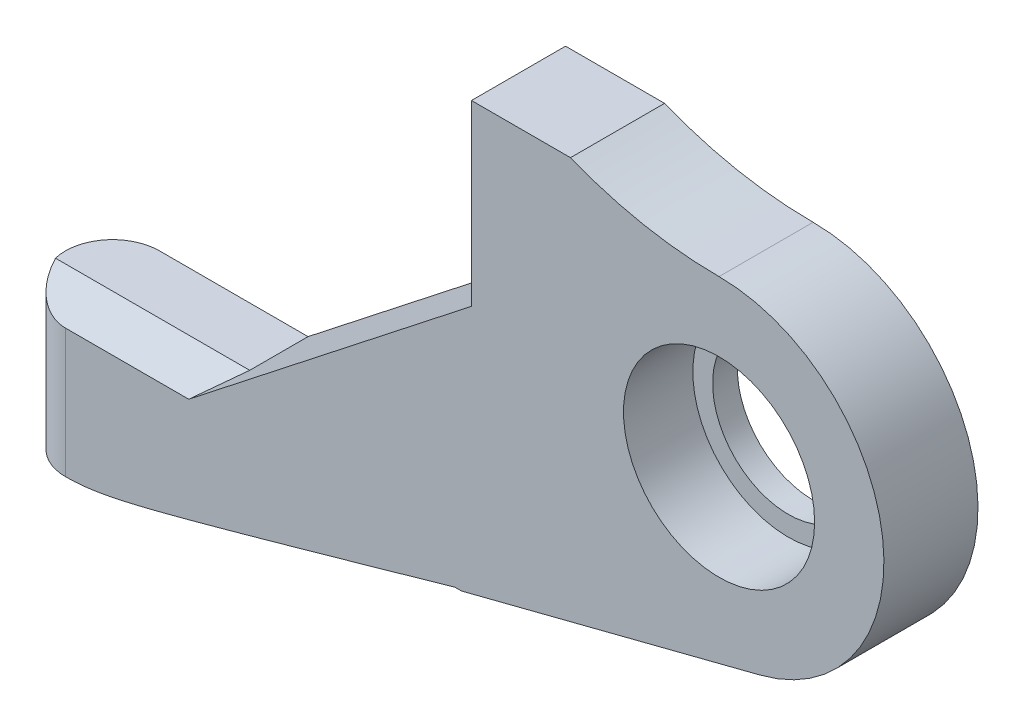
ISO-10303-21;
HEADER;
FILE_DESCRIPTION(('STEP AP214'),'2;1');
FILE_NAME('part.step','',(''),(''),'','','');
FILE_SCHEMA(('AUTOMOTIVE_DESIGN { 1 0 10303 214 1 1 1 1 }'));
ENDSEC;
DATA;
#1=APPLICATION_CONTEXT('core data for automotive mechanical design processes');
#2=APPLICATION_PROTOCOL_DEFINITION('international standard','automotive_design',2000,#1);
#3=PRODUCT_CONTEXT('',#1,'mechanical');
#4=PRODUCT('Part','Part','',(#3));
#5=PRODUCT_RELATED_PRODUCT_CATEGORY('part','',(#4));
#6=PRODUCT_DEFINITION_FORMATION('','',#4);
#7=PRODUCT_DEFINITION_CONTEXT('part definition',#1,'design');
#8=PRODUCT_DEFINITION('design','',#6,#7);
#9=PRODUCT_DEFINITION_SHAPE('','',#8);
#10=(LENGTH_UNIT() NAMED_UNIT(*) SI_UNIT(.MILLI.,.METRE.));
#11=(NAMED_UNIT(*) PLANE_ANGLE_UNIT() SI_UNIT($,.RADIAN.));
#12=(NAMED_UNIT(*) SI_UNIT($,.STERADIAN.) SOLID_ANGLE_UNIT());
#13=UNCERTAINTY_MEASURE_WITH_UNIT(LENGTH_MEASURE(1.E-05),#10,'distance_accuracy_value','');
#14=(GEOMETRIC_REPRESENTATION_CONTEXT(3) GLOBAL_UNCERTAINTY_ASSIGNED_CONTEXT((#13)) GLOBAL_UNIT_ASSIGNED_CONTEXT((#10,
#11,#12)) REPRESENTATION_CONTEXT('',''));
#15=CARTESIAN_POINT('',(0.,0.,0.));
#16=DIRECTION('',(0.,0.,1.));
#17=DIRECTION('',(1.,0.,0.));
#18=AXIS2_PLACEMENT_3D('',#15,#16,#17);
#19=CARTESIAN_POINT('',(16.35,-29.65,4.75));
#20=DIRECTION('',(0.,0.,1.));
#21=DIRECTION('',(1.,0.,0.));
#22=AXIS2_PLACEMENT_3D('',#19,#20,#21);
#23=PLANE('',#22);
#24=CARTESIAN_POINT('',(16.35,-29.65,4.75));
#25=DIRECTION('',(0.,0.,1.));
#26=DIRECTION('',(1.,0.,0.));
#27=AXIS2_PLACEMENT_3D('',#24,#25,#26);
#28=CIRCLE('',#27,16.65);
#29=CARTESIAN_POINT('',(20.4827919201644,-45.7789345880199,4.75));
#30=VERTEX_POINT('',#29);
#31=CARTESIAN_POINT('',(16.3500000000001,-13.,4.75));
#32=VERTEX_POINT('',#31);
#33=EDGE_CURVE('E185',#30,#32,#28,.T.);
#34=ORIENTED_EDGE('',*,*,#33,.T.);
#35=CARTESIAN_POINT('',(16.35,27.2431034482756,4.75));
#36=DIRECTION('',(0.,0.,1.));
#37=DIRECTION('',(1.,0.,0.));
#38=AXIS2_PLACEMENT_3D('',#35,#36,#37);
#39=CIRCLE('',#38,40.2431034482756);
#40=CARTESIAN_POINT('',(1.35000000000002,-10.1,4.75));
#41=VERTEX_POINT('',#40);
#42=EDGE_CURVE('E127',#41,#32,#39,.T.);
#43=ORIENTED_EDGE('',*,*,#42,.F.);
#44=DIRECTION('',(1.,0.,0.));
#45=VECTOR('',#44,1.);
#46=CARTESIAN_POINT('',(-8.64999999999998,-10.1,4.75));
#47=LINE('',#46,#45);
#48=CARTESIAN_POINT('',(-8.64999999999998,-10.1,4.75));
#49=VERTEX_POINT('',#48);
#50=EDGE_CURVE('E121',#49,#41,#47,.T.);
#51=ORIENTED_EDGE('',*,*,#50,.F.);
#52=DIRECTION('',(0.,1.,0.));
#53=VECTOR('',#52,1.);
#54=CARTESIAN_POINT('',(-8.64999999999998,-28.1013112114567,4.75));
#55=LINE('',#54,#53);
#56=CARTESIAN_POINT('',(-8.64999999999998,-28.1013112114567,4.75));
#57=VERTEX_POINT('',#56);
#58=EDGE_CURVE('E126',#57,#49,#55,.T.);
#59=ORIENTED_EDGE('',*,*,#58,.F.);
#60=DIRECTION('',(-0.786757426627153,-0.617262303763173,0.));
#61=VECTOR('',#60,1.);
#62=CARTESIAN_POINT('',(-34.65,-48.5,4.75));
#63=LINE('',#62,#61);
#64=CARTESIAN_POINT('',(-37.1991834567918,-50.5,4.75));
#65=VERTEX_POINT('',#64);
#66=EDGE_CURVE('E187',#57,#65,#63,.T.);
#67=ORIENTED_EDGE('',*,*,#66,.T.);
#68=DIRECTION('',(-1.,0.,0.));
#69=VECTOR('',#68,1.);
#70=CARTESIAN_POINT('',(-49.65,-50.5,4.75));
#71=LINE('',#70,#69);
#72=CARTESIAN_POINT('',(-49.65,-50.5,4.75));
#73=VERTEX_POINT('',#72);
#74=EDGE_CURVE('E315',#65,#73,#71,.T.);
#75=ORIENTED_EDGE('',*,*,#74,.T.);
#76=DIRECTION('',(0.,-1.,0.));
#77=VECTOR('',#76,1.);
#78=CARTESIAN_POINT('',(-49.65,-48.5,4.75));
#79=LINE('',#78,#77);
#80=CARTESIAN_POINT('',(-49.65,-63.5,4.75));
#81=VERTEX_POINT('',#80);
#82=EDGE_CURVE('E178',#73,#81,#79,.T.);
#83=ORIENTED_EDGE('',*,*,#82,.T.);
#84=CARTESIAN_POINT('',(-49.65,-63.5,4.75));
#85=CARTESIAN_POINT('',(-49.5478346514389,-63.5000034732593,4.75));
#86=CARTESIAN_POINT('',(-49.4456717505136,-63.4990544664872,4.75));
#87=CARTESIAN_POINT('',(-49.2413832701538,-63.4952813861621,4.75));
#88=CARTESIAN_POINT('',(-49.1392576897795,-63.4924573636201,4.75));
#89=CARTESIAN_POINT('',(-48.833052005964,-63.4812202753719,4.75));
#90=CARTESIAN_POINT('',(-48.6290680871602,-63.4700421473421,4.75));
#91=CARTESIAN_POINT('',(-48.2220793998145,-63.4409092581559,4.75));
#92=CARTESIAN_POINT('',(-48.0190734567737,-63.422970482818,4.75));
#93=CARTESIAN_POINT('',(-47.6136686075827,-63.3811079136988,4.75));
#94=CARTESIAN_POINT('',(-47.4112697562115,-63.3571835953505,4.75));
#95=CARTESIAN_POINT('',(-47.007754452504,-63.3043021436262,4.75));
#96=CARTESIAN_POINT('',(-46.8066359750545,-63.2753602871825,4.75));
#97=CARTESIAN_POINT('',(-46.4050656194471,-63.2132292509357,4.75));
#98=CARTESIAN_POINT('',(-46.204613728707,-63.1800401517748,4.75));
#99=CARTESIAN_POINT('',(-45.8041799616414,-63.1101325511454,4.75));
#100=CARTESIAN_POINT('',(-45.6041985336461,-63.0734114982117,4.75));
#101=CARTESIAN_POINT('',(-45.2047910474823,-62.9970871789972,4.75));
#102=CARTESIAN_POINT('',(-45.0053649854873,-62.9574839326257,4.75));
#103=CARTESIAN_POINT('',(-44.4111460851445,-62.835840264091,4.75));
#104=CARTESIAN_POINT('',(-44.0170583312952,-62.7503608183261,4.75));
#105=CARTESIAN_POINT('',(-43.2302807775824,-62.5731675944762,4.75));
#106=CARTESIAN_POINT('',(-42.8375910670808,-62.4814534251432,4.75));
#107=CARTESIAN_POINT('',(-42.053186595705,-62.2936674669584,4.75));
#108=CARTESIAN_POINT('',(-41.6614720162758,-62.1975949229899,4.75));
#109=CARTESIAN_POINT('',(-40.8788146921833,-62.0023530211257,4.75));
#110=CARTESIAN_POINT('',(-40.4878719549887,-61.9031836334184,4.75));
#111=CARTESIAN_POINT('',(-39.7064987320243,-61.7025608232851,4.75));
#112=CARTESIAN_POINT('',(-39.3160683518408,-61.6011069904876,4.75));
#113=CARTESIAN_POINT('',(-38.535652859175,-61.3964954204355,4.75));
#114=CARTESIAN_POINT('',(-38.1456677491283,-61.2933376739081,4.75));
#115=CARTESIAN_POINT('',(-36.9763148110716,-60.981956615022,4.75));
#116=CARTESIAN_POINT('',(-36.1974614906308,-60.771802701627,4.75));
#117=CARTESIAN_POINT('',(-34.6366254832957,-60.3472495644392,4.75));
#118=CARTESIAN_POINT('',(-33.8546472321096,-60.1328340960908,4.75));
#119=CARTESIAN_POINT('',(-32.2912530955681,-59.7018799943206,4.75));
#120=CARTESIAN_POINT('',(-31.5098372263933,-59.4853413022403,4.75));
#121=CARTESIAN_POINT('',(-29.9475674128916,-59.0508475681949,4.75));
#122=CARTESIAN_POINT('',(-29.1667133876591,-58.8328928168217,4.75));
#123=CARTESIAN_POINT('',(-27.6053055633076,-58.3959339229309,4.75));
#124=CARTESIAN_POINT('',(-26.824751761945,-58.176929788427,4.75));
#125=CARTESIAN_POINT('',(-24.7289924627198,-57.5877939832384,4.75));
#126=CARTESIAN_POINT('',(-23.4139865670331,-57.2169524757699,4.75));
#127=CARTESIAN_POINT('',(-20.7842883327001,-56.4738556141379,4.75));
#128=CARTESIAN_POINT('',(-19.4695960179694,-56.1016001754117,4.75));
#129=CARTESIAN_POINT('',(-16.8475388308592,-55.3581474796739,4.75));
#130=CARTESIAN_POINT('',(-15.5401725251701,-54.9869552763933,4.75));
#131=CARTESIAN_POINT('',(-12.925714564526,-54.2439133196049,4.75));
#132=CARTESIAN_POINT('',(-11.6186228975523,-53.8720636083907,4.75));
#133=CARTESIAN_POINT('',(-10.3115922732507,-53.5,4.75));
#134=B_SPLINE_CURVE_WITH_KNOTS('',3,(#84,#85,#86,#87,#88,#89,#90,#91,#92,#93,#94,#95,#96,#97,
#98,#99,#100,#101,#102,#103,#104,#105,#106,#107,#108,#109,#110,#111,#112,#113,#114,#115,#116,
#117,#118,#119,#120,#121,#122,#123,#124,#125,#126,#127,#128,#129,#130,#131,#132,#133),
.UNSPECIFIED.,.F.,.F.,(4,2,2,2,2,2,2,2,2,2,2,2,2,2,2,2,2,2,2,2,2,2,2,2,4),(0.,0.306486964394448,
0.612965590956772,1.22569836295275,1.83699130270519,2.44833783433824,3.05785467645869,
3.66735994743082,4.27730887697855,4.88725359357896,6.09692095763265,7.3066643022082,
8.51661804916271,9.72658344731956,10.9367679623401,12.1469590654257,14.5670689101879,
16.9995901109419,19.4321787056242,21.8642829512934,24.296368653833,28.3952543655064,
32.4943892052196,36.5715096360111,40.6483767139711),.UNSPECIFIED.);
#135=CARTESIAN_POINT('',(-10.3115922732507,-53.5,4.75));
#136=VERTEX_POINT('',#135);
#137=EDGE_CURVE('E211',#81,#136,#134,.T.);
#138=ORIENTED_EDGE('',*,*,#137,.T.);
#139=DIRECTION('',(1.,0.,0.));
#140=VECTOR('',#139,1.);
#141=CARTESIAN_POINT('',(-49.65,-53.5,4.75));
#142=LINE('',#141,#140);
#143=CARTESIAN_POINT('',(-9.64999999999997,-53.5,4.75));
#144=VERTEX_POINT('',#143);
#145=EDGE_CURVE('E180',#136,#144,#142,.T.);
#146=ORIENTED_EDGE('',*,*,#145,.T.);
#147=DIRECTION('',(0.968704780061254,0.248215730940804,0.));
#148=VECTOR('',#147,1.);
#149=CARTESIAN_POINT('',(-9.64999999999997,-53.5,4.75));
#150=LINE('',#149,#148);
#151=EDGE_CURVE('E183',#144,#30,#150,.T.);
#152=ORIENTED_EDGE('',*,*,#151,.T.);
#153=EDGE_LOOP('',(#34,#43,#51,#59,#67,#75,#83,#138,#146,#152));
#154=FACE_BOUND('',#153,.T.);
#155=CARTESIAN_POINT('',(16.35,-29.65,4.75));
#156=DIRECTION('',(0.,0.,1.));
#157=DIRECTION('',(1.,0.,0.));
#158=AXIS2_PLACEMENT_3D('',#155,#156,#157);
#159=CIRCLE('',#158,9.65);
#160=CARTESIAN_POINT('',(26.,-29.65,4.75));
#161=VERTEX_POINT('',#160);
#162=EDGE_CURVE('E157',#161,#161,#159,.T.);
#163=ORIENTED_EDGE('',*,*,#162,.F.);
#164=EDGE_LOOP('',(#163));
#165=FACE_BOUND('',#164,.T.);
#166=ADVANCED_FACE('F36',(#154,#165),#23,.T.);
#167=CARTESIAN_POINT('',(16.35,-29.65,-4.75));
#168=DIRECTION('',(0.,0.,1.));
#169=DIRECTION('',(1.,0.,0.));
#170=AXIS2_PLACEMENT_3D('',#167,#168,#169);
#171=PLANE('',#170);
#172=DIRECTION('',(-0.786757426627153,-0.617262303763173,0.));
#173=VECTOR('',#172,1.);
#174=CARTESIAN_POINT('',(-34.65,-48.5,-4.75));
#175=LINE('',#174,#173);
#176=CARTESIAN_POINT('',(-8.64999999999997,-28.1013112114567,-4.75));
#177=VERTEX_POINT('',#176);
#178=CARTESIAN_POINT('',(-34.65,-48.5,-4.75));
#179=VERTEX_POINT('',#178);
#180=EDGE_CURVE('E198',#177,#179,#175,.T.);
#181=ORIENTED_EDGE('',*,*,#180,.F.);
#182=DIRECTION('',(0.,1.,0.));
#183=VECTOR('',#182,1.);
#184=CARTESIAN_POINT('',(-8.64999999999998,-28.1013112114567,-4.75));
#185=LINE('',#184,#183);
#186=CARTESIAN_POINT('',(-8.64999999999998,-10.1,-4.75));
#187=VERTEX_POINT('',#186);
#188=EDGE_CURVE('E52',#177,#187,#185,.T.);
#189=ORIENTED_EDGE('',*,*,#188,.T.);
#190=DIRECTION('',(1.,0.,0.));
#191=VECTOR('',#190,1.);
#192=CARTESIAN_POINT('',(-8.64999999999998,-10.1,-4.75));
#193=LINE('',#192,#191);
#194=CARTESIAN_POINT('',(1.35000000000002,-10.1,-4.75));
#195=VERTEX_POINT('',#194);
#196=EDGE_CURVE('E136',#187,#195,#193,.T.);
#197=ORIENTED_EDGE('',*,*,#196,.T.);
#198=CARTESIAN_POINT('',(16.35,27.2431034482756,-4.75));
#199=DIRECTION('',(0.,0.,1.));
#200=DIRECTION('',(1.,0.,0.));
#201=AXIS2_PLACEMENT_3D('',#198,#199,#200);
#202=CIRCLE('',#201,40.2431034482756);
#203=CARTESIAN_POINT('',(16.3500000000001,-13.,-4.75));
#204=VERTEX_POINT('',#203);
#205=EDGE_CURVE('E141',#195,#204,#202,.T.);
#206=ORIENTED_EDGE('',*,*,#205,.T.);
#207=CARTESIAN_POINT('',(16.35,-29.65,-4.75));
#208=DIRECTION('',(0.,0.,1.));
#209=DIRECTION('',(1.,0.,0.));
#210=AXIS2_PLACEMENT_3D('',#207,#208,#209);
#211=CIRCLE('',#210,16.65);
#212=CARTESIAN_POINT('',(20.4827919201644,-45.7789345880199,-4.75));
#213=VERTEX_POINT('',#212);
#214=EDGE_CURVE('E195',#213,#204,#211,.T.);
#215=ORIENTED_EDGE('',*,*,#214,.F.);
#216=DIRECTION('',(0.968704780061254,0.248215730940804,0.));
#217=VECTOR('',#216,1.);
#218=CARTESIAN_POINT('',(-9.64999999999997,-53.5,-4.75));
#219=LINE('',#218,#217);
#220=CARTESIAN_POINT('',(-9.64999999999997,-53.5,-4.75));
#221=VERTEX_POINT('',#220);
#222=EDGE_CURVE('E193',#221,#213,#219,.T.);
#223=ORIENTED_EDGE('',*,*,#222,.F.);
#224=DIRECTION('',(1.,0.,0.));
#225=VECTOR('',#224,1.);
#226=CARTESIAN_POINT('',(-49.65,-53.5,-4.75));
#227=LINE('',#226,#225);
#228=CARTESIAN_POINT('',(-10.3115922732507,-53.5,-4.75));
#229=VERTEX_POINT('',#228);
#230=EDGE_CURVE('E191',#229,#221,#227,.T.);
#231=ORIENTED_EDGE('',*,*,#230,.F.);
#232=CARTESIAN_POINT('',(-10.3115922732507,-53.5,-4.75));
#233=CARTESIAN_POINT('',(-11.1250876335738,-53.7315831545141,-4.75));
#234=CARTESIAN_POINT('',(-11.9386096187926,-53.9630727391213,-4.75));
#235=CARTESIAN_POINT('',(-13.5657195997596,-54.4258201232694,-4.75));
#236=CARTESIAN_POINT('',(-14.379307595515,-54.6570779227858,-4.75));
#237=CARTESIAN_POINT('',(-16.8197486019085,-55.3503113657505,-4.75));
#238=CARTESIAN_POINT('',(-18.4467194247053,-55.8118725893858,-4.75));
#239=CARTESIAN_POINT('',(-20.8869702863346,-56.5027460431235,-4.75));
#240=CARTESIAN_POINT('',(-21.7000654110398,-56.7327113719937,-4.75));
#241=CARTESIAN_POINT('',(-23.3264093911989,-57.1920749401148,-4.75));
#242=CARTESIAN_POINT('',(-24.1396582454734,-57.4214731835406,-4.75));
#243=CARTESIAN_POINT('',(-25.7665718859053,-57.8795872834729,-4.75));
#244=CARTESIAN_POINT('',(-26.5802367252437,-58.1083029511837,-4.75));
#245=CARTESIAN_POINT('',(-28.2078690190344,-58.5647399410036,-4.75));
#246=CARTESIAN_POINT('',(-29.021836481052,-58.7924612361462,-4.75));
#247=CARTESIAN_POINT('',(-30.6513729114953,-59.2468508925669,-4.75));
#248=CARTESIAN_POINT('',(-31.4669424589948,-59.4735171792381,-4.75));
#249=CARTESIAN_POINT('',(-33.0985620938164,-59.9248026279289,-4.75));
#250=CARTESIAN_POINT('',(-33.9146121262508,-60.1494219882706,-4.75));
#251=CARTESIAN_POINT('',(-35.5468825488044,-60.595423487618,-4.75));
#252=CARTESIAN_POINT('',(-36.3631022544718,-60.816808122581,-4.75));
#253=CARTESIAN_POINT('',(-37.588583125176,-61.1451799969305,-4.75));
#254=CARTESIAN_POINT('',(-37.9973423483379,-61.2540390451507,-4.75));
#255=CARTESIAN_POINT('',(-38.815298557704,-61.4700984814278,-4.75));
#256=CARTESIAN_POINT('',(-39.2244955428031,-61.5772988736612,-4.75));
#257=CARTESIAN_POINT('',(-40.0446603964643,-61.7897935048608,-4.75));
#258=CARTESIAN_POINT('',(-40.455629947115,-61.8950812641787,-4.75));
#259=CARTESIAN_POINT('',(-41.2783245565476,-62.1025864664053,-4.75));
#260=CARTESIAN_POINT('',(-41.690049576107,-62.204804064178,-4.75));
#261=CARTESIAN_POINT('',(-42.5141005282538,-62.4047916433276,-4.75));
#262=CARTESIAN_POINT('',(-42.9264252949878,-62.5025664120453,-4.75));
#263=CARTESIAN_POINT('',(-43.7526208316703,-62.6918589978744,-4.75));
#264=CARTESIAN_POINT('',(-44.1664919114898,-62.7833754811327,-4.75));
#265=CARTESIAN_POINT('',(-44.7896107033845,-62.9137365151962,-4.75));
#266=CARTESIAN_POINT('',(-44.9981177860803,-62.9561149780571,-4.75));
#267=CARTESIAN_POINT('',(-45.4157090472606,-63.0379159727059,-4.75));
#268=CARTESIAN_POINT('',(-45.6247932116977,-63.0773385757991,-4.75));
#269=CARTESIAN_POINT('',(-46.043496288356,-63.152529097747,-4.75));
#270=CARTESIAN_POINT('',(-46.2531148182366,-63.1882991316449,-4.75));
#271=CARTESIAN_POINT('',(-46.6730733297343,-63.2553912898376,-4.75));
#272=CARTESIAN_POINT('',(-46.8834133269178,-63.286713317535,-4.75));
#273=CARTESIAN_POINT('',(-47.3056568832013,-63.3440827704863,-4.75));
#274=CARTESIAN_POINT('',(-47.5175633405165,-63.3701091197917,-4.75));
#275=CARTESIAN_POINT('',(-47.94205471255,-63.4157267137478,-4.75));
#276=CARTESIAN_POINT('',(-48.1546395572104,-63.4353186024798,-4.75));
#277=CARTESIAN_POINT('',(-48.5808240585038,-63.467169798201,-4.75));
#278=CARTESIAN_POINT('',(-48.7944249098423,-63.4794135524367,-4.75));
#279=CARTESIAN_POINT('',(-49.1150913710183,-63.4917283775562,-4.75));
#280=CARTESIAN_POINT('',(-49.2220466656247,-63.4948248658202,-4.75));
#281=CARTESIAN_POINT('',(-49.436000365757,-63.4989628068429,-4.75));
#282=CARTESIAN_POINT('',(-49.5429987725713,-63.5000041927971,-4.75));
#283=CARTESIAN_POINT('',(-49.65,-63.5,-4.75));
#284=B_SPLINE_CURVE_WITH_KNOTS('',3,(#232,#233,#234,#235,#236,#237,#238,#239,#240,#241,#242,
#243,#244,#245,#246,#247,#248,#249,#250,#251,#252,#253,#254,#255,#256,#257,#258,#259,#260,#261,
#262,#263,#264,#265,#266,#267,#268,#269,#270,#271,#272,#273,#274,#275,#276,#277,#278,#279,#280,
#281,#282,#283),.UNSPECIFIED.,.F.,.F.,(4,2,2,2,2,2,2,2,2,2,2,2,2,2,2,2,2,2,2,2,2,2,2,2,2,4),(0.,
2.53744929897906,5.07489886785471,10.1484230441172,12.6833922481678,15.2183427340827,
17.753939221526,20.2896040502735,22.8290472704816,25.3682417762353,27.9053608059997,
29.1743774592887,30.443390916632,31.716109716508,32.9887642101671,34.2600131637095,
35.531532224521,36.1698263207263,36.808105014155,37.4460119869946,38.083932811153,
38.7243448312066,39.3646927272777,40.0063912203649,40.3273740388545,40.6483672912628),.UNSPECIFIED.);
#285=CARTESIAN_POINT('',(-49.65,-63.5,-4.75));
#286=VERTEX_POINT('',#285);
#287=EDGE_CURVE('E218',#229,#286,#284,.T.);
#288=ORIENTED_EDGE('',*,*,#287,.T.);
#289=DIRECTION('',(0.,-1.,0.));
#290=VECTOR('',#289,1.);
#291=CARTESIAN_POINT('',(-49.65,-48.5,-4.75));
#292=LINE('',#291,#290);
#293=CARTESIAN_POINT('',(-49.65,-48.5,-4.75));
#294=VERTEX_POINT('',#293);
#295=EDGE_CURVE('E177',#294,#286,#292,.T.);
#296=ORIENTED_EDGE('',*,*,#295,.F.);
#297=DIRECTION('',(-1.,0.,0.));
#298=VECTOR('',#297,1.);
#299=CARTESIAN_POINT('',(-49.65,-48.5,-4.75));
#300=LINE('',#299,#298);
#301=EDGE_CURVE('E181',#179,#294,#300,.T.);
#302=ORIENTED_EDGE('',*,*,#301,.F.);
#303=EDGE_LOOP('',(#181,#189,#197,#206,#215,#223,#231,#288,#296,#302));
#304=FACE_BOUND('',#303,.T.);
#305=CARTESIAN_POINT('',(16.35,-29.65,-4.75));
#306=DIRECTION('',(0.,0.,1.));
#307=DIRECTION('',(1.,0.,0.));
#308=AXIS2_PLACEMENT_3D('',#305,#306,#307);
#309=CIRCLE('',#308,7.65);
#310=CARTESIAN_POINT('',(24.,-29.65,-4.75));
#311=VERTEX_POINT('',#310);
#312=EDGE_CURVE('E158',#311,#311,#309,.T.);
#313=ORIENTED_EDGE('',*,*,#312,.T.);
#314=EDGE_LOOP('',(#313));
#315=FACE_BOUND('',#314,.T.);
#316=ADVANCED_FACE('F232',(#304,#315),#171,.F.);
#317=CARTESIAN_POINT('',(-49.65,-53.5,4.75));
#318=DIRECTION('',(0.,1.,0.));
#319=DIRECTION('',(-1.,0.,0.));
#320=AXIS2_PLACEMENT_3D('',#317,#318,#319);
#321=PLANE('',#320);
#322=ORIENTED_EDGE('',*,*,#145,.F.);
#323=CARTESIAN_POINT('',(-49.65,-53.5,0.));
#324=DIRECTION('',(0.,1.,0.));
#325=DIRECTION('',(-1.,0.,0.));
#326=AXIS2_PLACEMENT_3D('',#323,#324,#325);
#327=CIRCLE('',#326,39.6241444384098);
#328=EDGE_CURVE('E209',#136,#229,#327,.T.);
#329=ORIENTED_EDGE('',*,*,#328,.T.);
#330=ORIENTED_EDGE('',*,*,#230,.T.);
#331=DIRECTION('',(0.,0.,-1.));
#332=VECTOR('',#331,1.);
#333=CARTESIAN_POINT('',(-9.64999999999997,-53.5,4.75));
#334=LINE('',#333,#332);
#335=EDGE_CURVE('E206',#144,#221,#334,.T.);
#336=ORIENTED_EDGE('',*,*,#335,.F.);
#337=EDGE_LOOP('',(#322,#329,#330,#336));
#338=FACE_BOUND('',#337,.T.);
#339=ADVANCED_FACE('F238',(#338),#321,.F.);
#340=CARTESIAN_POINT('',(-9.64999999999997,-53.5,4.75));
#341=DIRECTION('',(-0.248215730940804,0.968704780061254,0.));
#342=DIRECTION('',(-0.968704780061254,-0.248215730940804,0.));
#343=AXIS2_PLACEMENT_3D('',#340,#341,#342);
#344=PLANE('',#343);
#345=ORIENTED_EDGE('',*,*,#222,.T.);
#346=DIRECTION('',(0.,0.,-1.));
#347=VECTOR('',#346,1.);
#348=CARTESIAN_POINT('',(20.4827919201644,-45.7789345880199,4.75));
#349=LINE('',#348,#347);
#350=EDGE_CURVE('E203',#30,#213,#349,.T.);
#351=ORIENTED_EDGE('',*,*,#350,.F.);
#352=ORIENTED_EDGE('',*,*,#151,.F.);
#353=ORIENTED_EDGE('',*,*,#335,.T.);
#354=EDGE_LOOP('',(#345,#351,#352,#353));
#355=FACE_BOUND('',#354,.T.);
#356=ADVANCED_FACE('F250',(#355),#344,.F.);
#357=CARTESIAN_POINT('',(16.35,-29.65,4.75));
#358=DIRECTION('',(0.,0.,-1.));
#359=DIRECTION('',(-1.,0.,0.));
#360=AXIS2_PLACEMENT_3D('',#357,#358,#359);
#361=CYLINDRICAL_SURFACE('',#360,16.65);
#362=ORIENTED_EDGE('',*,*,#214,.T.);
#363=DIRECTION('',(0.,0.,-1.));
#364=VECTOR('',#363,1.);
#365=CARTESIAN_POINT('',(16.3500000000001,-13.,35.5566097669269));
#366=LINE('',#365,#364);
#367=EDGE_CURVE('E148',#32,#204,#366,.T.);
#368=ORIENTED_EDGE('',*,*,#367,.F.);
#369=ORIENTED_EDGE('',*,*,#33,.F.);
#370=ORIENTED_EDGE('',*,*,#350,.T.);
#371=EDGE_LOOP('',(#362,#368,#369,#370));
#372=FACE_BOUND('',#371,.T.);
#373=ADVANCED_FACE('F246',(#372),#361,.T.);
#374=CARTESIAN_POINT('',(-34.65,-48.5,4.75));
#375=DIRECTION('',(0.617262303763173,-0.786757426627153,0.));
#376=DIRECTION('',(0.786757426627153,0.617262303763173,0.));
#377=AXIS2_PLACEMENT_3D('',#374,#375,#376);
#378=PLANE('',#377);
#379=ORIENTED_EDGE('',*,*,#66,.F.);
#380=DIRECTION('',(0.,0.,-1.));
#381=VECTOR('',#380,1.);
#382=CARTESIAN_POINT('',(-8.64999999999998,-28.1013112114567,35.5566097669269));
#383=LINE('',#382,#381);
#384=EDGE_CURVE('E139',#57,#177,#383,.T.);
#385=ORIENTED_EDGE('',*,*,#384,.T.);
#386=ORIENTED_EDGE('',*,*,#180,.T.);
#387=DIRECTION('',(0.,0.,-1.));
#388=VECTOR('',#387,1.);
#389=CARTESIAN_POINT('',(-34.65,-48.5,4.75));
#390=LINE('',#389,#388);
#391=CARTESIAN_POINT('',(-34.65,-48.5,1.14190448945714));
#392=VERTEX_POINT('',#391);
#393=EDGE_CURVE('E189',#392,#179,#390,.T.);
#394=ORIENTED_EDGE('',*,*,#393,.F.);
#395=DIRECTION('',(-0.525669765515223,-0.412422075088138,0.744029118787138));
#396=VECTOR('',#395,1.);
#397=CARTESIAN_POINT('',(-36.0611752690463,-49.6071586592063,3.13927158332764));
#398=LINE('',#397,#396);
#399=EDGE_CURVE('E12',#392,#65,#398,.T.);
#400=ORIENTED_EDGE('',*,*,#399,.T.);
#401=EDGE_LOOP('',(#379,#385,#386,#394,#400));
#402=FACE_BOUND('',#401,.T.);
#403=ADVANCED_FACE('F243',(#402),#378,.F.);
#404=CARTESIAN_POINT('',(-49.65,-48.5,4.75));
#405=DIRECTION('',(0.,-1.,0.));
#406=DIRECTION('',(0.,0.,-1.));
#407=AXIS2_PLACEMENT_3D('',#404,#405,#406);
#408=PLANE('',#407);
#409=CARTESIAN_POINT('',(-49.65,-48.5,0.));
#410=DIRECTION('',(0.,-1.,0.));
#411=DIRECTION('',(0.,0.,-1.));
#412=AXIS2_PLACEMENT_3D('',#409,#410,#411);
#413=CIRCLE('',#412,4.75);
#414=CARTESIAN_POINT('',(-54.2606999617149,-48.5,1.14190448945714));
#415=VERTEX_POINT('',#414);
#416=EDGE_CURVE('E175',#294,#415,#413,.F.);
#417=ORIENTED_EDGE('',*,*,#416,.T.);
#418=DIRECTION('',(1.,0.,0.));
#419=VECTOR('',#418,1.);
#420=CARTESIAN_POINT('',(-34.65,-48.5,1.14190448945714));
#421=LINE('',#420,#419);
#422=EDGE_CURVE('E45',#415,#392,#421,.T.);
#423=ORIENTED_EDGE('',*,*,#422,.T.);
#424=ORIENTED_EDGE('',*,*,#393,.T.);
#425=ORIENTED_EDGE('',*,*,#301,.T.);
#426=EDGE_LOOP('',(#417,#423,#424,#425));
#427=FACE_BOUND('',#426,.T.);
#428=ADVANCED_FACE('F240',(#427),#408,.F.);
#429=CARTESIAN_POINT('',(-49.65,-37.878677106876,0.));
#430=DIRECTION('',(0.,-1.,0.));
#431=DIRECTION('',(0.,0.,-1.));
#432=AXIS2_PLACEMENT_3D('',#429,#430,#431);
#433=CYLINDRICAL_SURFACE('',#432,4.75);
#434=ORIENTED_EDGE('',*,*,#82,.F.);
#435=CARTESIAN_POINT('',(-49.65,-47.8670320055994,0.));
#436=DIRECTION('',(0.,0.874619707139396,0.484809620246337));
#437=DIRECTION('',(0.,-0.484809620246337,0.874619707139396));
#438=AXIS2_PLACEMENT_3D('',#435,#436,#437);
#439=ELLIPSE('',#438,5.43093182239827,4.75);
#440=EDGE_CURVE('E311',#73,#415,#439,.F.);
#441=ORIENTED_EDGE('',*,*,#440,.T.);
#442=ORIENTED_EDGE('',*,*,#416,.F.);
#443=ORIENTED_EDGE('',*,*,#295,.T.);
#444=CARTESIAN_POINT('',(-49.65,-63.5,0.));
#445=DIRECTION('',(0.,-1.,0.));
#446=DIRECTION('',(0.,0.,-1.));
#447=AXIS2_PLACEMENT_3D('',#444,#445,#446);
#448=CIRCLE('',#447,4.75);
#449=EDGE_CURVE('E169',#81,#286,#448,.T.);
#450=ORIENTED_EDGE('',*,*,#449,.F.);
#451=EDGE_LOOP('',(#434,#441,#442,#443,#450));
#452=FACE_BOUND('',#451,.T.);
#453=ADVANCED_FACE('F233',(#452),#433,.T.);
#454=CARTESIAN_POINT('',(-49.65,-63.5,0.));
#455=DIRECTION('',(0.,-1.,0.));
#456=DIRECTION('',(0.,0.,-1.));
#457=AXIS2_PLACEMENT_3D('',#454,#455,#456);
#458=PLANE('',#457);
#459=EDGE_CURVE('E172',#286,#81,#448,.T.);
#460=ORIENTED_EDGE('',*,*,#459,.T.);
#461=ORIENTED_EDGE('',*,*,#449,.T.);
#462=EDGE_LOOP('',(#460,#461));
#463=FACE_BOUND('',#462,.T.);
#464=CARTESIAN_POINT('',(-49.65,-63.5,0.));
#465=DIRECTION('',(0.,-1.,0.));
#466=DIRECTION('',(0.,0.,-1.));
#467=AXIS2_PLACEMENT_3D('',#464,#465,#466);
#468=CIRCLE('',#467,3.25);
#469=CARTESIAN_POINT('',(-49.65,-63.5,-3.25));
#470=VERTEX_POINT('',#469);
#471=EDGE_CURVE('E166',#470,#470,#468,.T.);
#472=ORIENTED_EDGE('',*,*,#471,.F.);
#473=EDGE_LOOP('',(#472));
#474=FACE_BOUND('',#473,.T.);
#475=ADVANCED_FACE('F269',(#463,#474),#458,.T.);
#476=CARTESIAN_POINT('',(-49.65,-63.5,0.));
#477=DIRECTION('',(0.,1.,0.));
#478=DIRECTION('',(0.,0.,1.));
#479=AXIS2_PLACEMENT_3D('',#476,#477,#478);
#480=CYLINDRICAL_SURFACE('',#479,3.25);
#481=ORIENTED_EDGE('',*,*,#471,.T.);
#482=EDGE_LOOP('',(#481));
#483=FACE_BOUND('',#482,.T.);
#484=CARTESIAN_POINT('',(-49.65,-53.5,0.));
#485=DIRECTION('',(0.,-1.,0.));
#486=DIRECTION('',(0.,0.,-1.));
#487=AXIS2_PLACEMENT_3D('',#484,#485,#486);
#488=CIRCLE('',#487,3.25);
#489=CARTESIAN_POINT('',(-49.65,-53.5,-3.25));
#490=VERTEX_POINT('',#489);
#491=EDGE_CURVE('E165',#490,#490,#488,.T.);
#492=ORIENTED_EDGE('',*,*,#491,.F.);
#493=EDGE_LOOP('',(#492));
#494=FACE_BOUND('',#493,.T.);
#495=ADVANCED_FACE('F261',(#483,#494),#480,.F.);
#496=ORIENTED_EDGE('',*,*,#491,.T.);
#497=EDGE_LOOP('',(#496));
#498=FACE_BOUND('',#497,.T.);
#499=ADVANCED_FACE('F256',(#498),#321,.F.);
#500=CARTESIAN_POINT('',(-49.65,-63.5,0.));
#501=DIRECTION('',(0.,1.,0.));
#502=DIRECTION('',(0.,0.,1.));
#503=AXIS2_PLACEMENT_3D('',#500,#501,#502);
#504=CONICAL_SURFACE('',#503,4.75,1.29154364647581);
#505=ORIENTED_EDGE('',*,*,#287,.F.);
#506=ORIENTED_EDGE('',*,*,#328,.F.);
#507=ORIENTED_EDGE('',*,*,#137,.F.);
#508=ORIENTED_EDGE('',*,*,#459,.F.);
#509=EDGE_LOOP('',(#505,#506,#507,#508));
#510=FACE_BOUND('',#509,.T.);
#511=ADVANCED_FACE('F226',(#510),#504,.T.);
#512=CARTESIAN_POINT('',(16.35,-29.65,-4.75));
#513=DIRECTION('',(0.,0.,1.));
#514=DIRECTION('',(1.,0.,0.));
#515=AXIS2_PLACEMENT_3D('',#512,#513,#514);
#516=CYLINDRICAL_SURFACE('',#515,9.65);
#517=CARTESIAN_POINT('',(16.35,-29.65,-2.25));
#518=DIRECTION('',(0.,0.,1.));
#519=DIRECTION('',(1.,0.,0.));
#520=AXIS2_PLACEMENT_3D('',#517,#518,#519);
#521=CIRCLE('',#520,9.65);
#522=CARTESIAN_POINT('',(26.,-29.65,-2.25));
#523=VERTEX_POINT('',#522);
#524=EDGE_CURVE('E154',#523,#523,#521,.T.);
#525=ORIENTED_EDGE('',*,*,#524,.F.);
#526=EDGE_LOOP('',(#525));
#527=FACE_BOUND('',#526,.T.);
#528=ORIENTED_EDGE('',*,*,#162,.T.);
#529=EDGE_LOOP('',(#528));
#530=FACE_BOUND('',#529,.T.);
#531=ADVANCED_FACE('F267',(#527,#530),#516,.F.);
#532=CARTESIAN_POINT('',(16.35,-29.65,32.0443217538007));
#533=DIRECTION('',(0.,0.,-1.));
#534=DIRECTION('',(-1.,0.,0.));
#535=AXIS2_PLACEMENT_3D('',#532,#533,#534);
#536=CYLINDRICAL_SURFACE('',#535,7.65);
#537=ORIENTED_EDGE('',*,*,#312,.F.);
#538=EDGE_LOOP('',(#537));
#539=FACE_BOUND('',#538,.T.);
#540=CARTESIAN_POINT('',(16.35,-29.65,-2.25));
#541=DIRECTION('',(0.,0.,1.));
#542=DIRECTION('',(1.,0.,0.));
#543=AXIS2_PLACEMENT_3D('',#540,#541,#542);
#544=CIRCLE('',#543,7.65);
#545=CARTESIAN_POINT('',(24.,-29.65,-2.25));
#546=VERTEX_POINT('',#545);
#547=EDGE_CURVE('E153',#546,#546,#544,.T.);
#548=ORIENTED_EDGE('',*,*,#547,.T.);
#549=EDGE_LOOP('',(#548));
#550=FACE_BOUND('',#549,.T.);
#551=ADVANCED_FACE('F281',(#539,#550),#536,.F.);
#552=CARTESIAN_POINT('',(16.35,-29.65,-2.25));
#553=DIRECTION('',(0.,0.,1.));
#554=DIRECTION('',(1.,0.,0.));
#555=AXIS2_PLACEMENT_3D('',#552,#553,#554);
#556=PLANE('',#555);
#557=ORIENTED_EDGE('',*,*,#547,.F.);
#558=EDGE_LOOP('',(#557));
#559=FACE_BOUND('',#558,.T.);
#560=ORIENTED_EDGE('',*,*,#524,.T.);
#561=EDGE_LOOP('',(#560));
#562=FACE_BOUND('',#561,.T.);
#563=ADVANCED_FACE('F285',(#559,#562),#556,.T.);
#564=CARTESIAN_POINT('',(16.35,-50.5,4.75));
#565=DIRECTION('',(0.,0.874619707139396,0.484809620246337));
#566=DIRECTION('',(1.,0.,0.));
#567=AXIS2_PLACEMENT_3D('',#564,#565,#566);
#568=PLANE('',#567);
#569=ORIENTED_EDGE('',*,*,#399,.F.);
#570=ORIENTED_EDGE('',*,*,#422,.F.);
#571=ORIENTED_EDGE('',*,*,#440,.F.);
#572=ORIENTED_EDGE('',*,*,#74,.F.);
#573=EDGE_LOOP('',(#569,#570,#571,#572));
#574=FACE_BOUND('',#573,.T.);
#575=ADVANCED_FACE('F39',(#574),#568,.T.);
#576=CARTESIAN_POINT('',(-8.64999999999998,-28.1013112114567,35.5566097669269));
#577=DIRECTION('',(-1.,0.,0.));
#578=DIRECTION('',(0.,0.,1.));
#579=AXIS2_PLACEMENT_3D('',#576,#577,#578);
#580=PLANE('',#579);
#581=ORIENTED_EDGE('',*,*,#384,.F.);
#582=ORIENTED_EDGE('',*,*,#58,.T.);
#583=DIRECTION('',(0.,0.,-1.));
#584=VECTOR('',#583,1.);
#585=CARTESIAN_POINT('',(-8.64999999999998,-10.1,35.5566097669269));
#586=LINE('',#585,#584);
#587=EDGE_CURVE('E131',#49,#187,#586,.T.);
#588=ORIENTED_EDGE('',*,*,#587,.T.);
#589=ORIENTED_EDGE('',*,*,#188,.F.);
#590=EDGE_LOOP('',(#581,#582,#588,#589));
#591=FACE_BOUND('',#590,.T.);
#592=ADVANCED_FACE('F138',(#591),#580,.T.);
#593=CARTESIAN_POINT('',(-8.64999999999998,-10.1,35.5566097669269));
#594=DIRECTION('',(0.,1.,0.));
#595=DIRECTION('',(0.,0.,1.));
#596=AXIS2_PLACEMENT_3D('',#593,#594,#595);
#597=PLANE('',#596);
#598=ORIENTED_EDGE('',*,*,#587,.F.);
#599=ORIENTED_EDGE('',*,*,#50,.T.);
#600=DIRECTION('',(0.,0.,-1.));
#601=VECTOR('',#600,1.);
#602=CARTESIAN_POINT('',(1.35000000000002,-10.1,35.5566097669269));
#603=LINE('',#602,#601);
#604=EDGE_CURVE('E130',#41,#195,#603,.T.);
#605=ORIENTED_EDGE('',*,*,#604,.T.);
#606=ORIENTED_EDGE('',*,*,#196,.F.);
#607=EDGE_LOOP('',(#598,#599,#605,#606));
#608=FACE_BOUND('',#607,.T.);
#609=ADVANCED_FACE('F134',(#608),#597,.T.);
#610=CARTESIAN_POINT('',(16.35,27.2431034482756,35.5566097669269));
#611=DIRECTION('',(0.,0.,-1.));
#612=DIRECTION('',(-1.,0.,0.));
#613=AXIS2_PLACEMENT_3D('',#610,#611,#612);
#614=CYLINDRICAL_SURFACE('',#613,40.2431034482756);
#615=ORIENTED_EDGE('',*,*,#604,.F.);
#616=ORIENTED_EDGE('',*,*,#42,.T.);
#617=ORIENTED_EDGE('',*,*,#367,.T.);
#618=ORIENTED_EDGE('',*,*,#205,.F.);
#619=EDGE_LOOP('',(#615,#616,#617,#618));
#620=FACE_BOUND('',#619,.T.);
#621=ADVANCED_FACE('F294',(#620),#614,.F.);
#622=CLOSED_SHELL('',(#166,#316,#339,#356,#373,#403,#428,#453,#475,#495,#499,#511,#531,#551,
#563,#575,#592,#609,#621));
#623=MANIFOLD_SOLID_BREP('B2',#622);
#624=ADVANCED_BREP_SHAPE_REPRESENTATION('',(#18,#623),#14);
#625=SHAPE_DEFINITION_REPRESENTATION(#9,#624);
ENDSEC;
END-ISO-10303-21;
